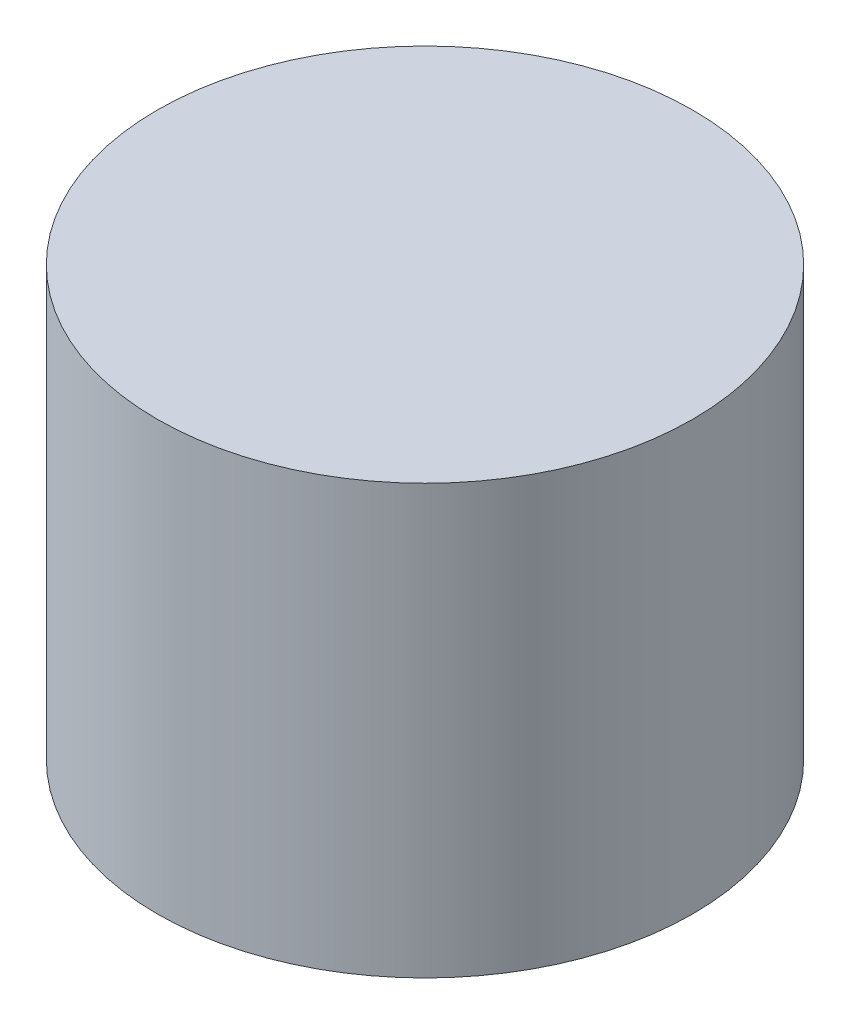
ISO-10303-21;
HEADER;
FILE_DESCRIPTION(('STEP AP214'),'2;1');
FILE_NAME('part.step','',(''),(''),'','','');
FILE_SCHEMA(('AUTOMOTIVE_DESIGN { 1 0 10303 214 1 1 1 1 }'));
ENDSEC;
DATA;
#1=APPLICATION_CONTEXT('core data for automotive mechanical design processes');
#2=APPLICATION_PROTOCOL_DEFINITION('international standard','automotive_design',2000,#1);
#3=PRODUCT_CONTEXT('',#1,'mechanical');
#4=PRODUCT('Part','Part','',(#3));
#5=PRODUCT_RELATED_PRODUCT_CATEGORY('part','',(#4));
#6=PRODUCT_DEFINITION_FORMATION('','',#4);
#7=PRODUCT_DEFINITION_CONTEXT('part definition',#1,'design');
#8=PRODUCT_DEFINITION('design','',#6,#7);
#9=PRODUCT_DEFINITION_SHAPE('','',#8);
#10=(LENGTH_UNIT() NAMED_UNIT(*) SI_UNIT(.MILLI.,.METRE.));
#11=(NAMED_UNIT(*) PLANE_ANGLE_UNIT() SI_UNIT($,.RADIAN.));
#12=(NAMED_UNIT(*) SI_UNIT($,.STERADIAN.) SOLID_ANGLE_UNIT());
#13=UNCERTAINTY_MEASURE_WITH_UNIT(LENGTH_MEASURE(1.E-05),#10,'distance_accuracy_value','');
#14=(GEOMETRIC_REPRESENTATION_CONTEXT(3) GLOBAL_UNCERTAINTY_ASSIGNED_CONTEXT((#13)) GLOBAL_UNIT_ASSIGNED_CONTEXT((#10,
#11,#12)) REPRESENTATION_CONTEXT('',''));
#15=CARTESIAN_POINT('',(0.,0.,0.));
#16=DIRECTION('',(0.,0.,1.));
#17=DIRECTION('',(1.,0.,0.));
#18=AXIS2_PLACEMENT_3D('',#15,#16,#17);
#19=CARTESIAN_POINT('',(0.,4.8,0.));
#20=DIRECTION('',(0.,-1.,0.));
#21=DIRECTION('',(0.,0.,-1.));
#22=AXIS2_PLACEMENT_3D('',#19,#20,#21);
#23=CYLINDRICAL_SURFACE('',#22,3.);
#24=CARTESIAN_POINT('',(0.,4.8,0.));
#25=DIRECTION('',(0.,1.,0.));
#26=DIRECTION('',(0.,0.,1.));
#27=AXIS2_PLACEMENT_3D('',#24,#25,#26);
#28=CIRCLE('',#27,3.);
#29=CARTESIAN_POINT('',(0.,4.8,3.));
#30=VERTEX_POINT('',#29);
#31=EDGE_CURVE('E10',#30,#30,#28,.T.);
#32=ORIENTED_EDGE('',*,*,#31,.F.);
#33=EDGE_LOOP('',(#32));
#34=FACE_BOUND('',#33,.T.);
#35=CARTESIAN_POINT('',(0.,0.,0.));
#36=DIRECTION('',(0.,1.,0.));
#37=DIRECTION('',(0.,0.,1.));
#38=AXIS2_PLACEMENT_3D('',#35,#36,#37);
#39=CIRCLE('',#38,3.);
#40=CARTESIAN_POINT('',(0.,0.,3.));
#41=VERTEX_POINT('',#40);
#42=EDGE_CURVE('E36',#41,#41,#39,.T.);
#43=ORIENTED_EDGE('',*,*,#42,.T.);
#44=EDGE_LOOP('',(#43));
#45=FACE_BOUND('',#44,.T.);
#46=ADVANCED_FACE('F33',(#34,#45),#23,.T.);
#47=CARTESIAN_POINT('',(0.,4.8,0.));
#48=DIRECTION('',(0.,1.,0.));
#49=DIRECTION('',(0.,0.,1.));
#50=AXIS2_PLACEMENT_3D('',#47,#48,#49);
#51=PLANE('',#50);
#52=ORIENTED_EDGE('',*,*,#31,.T.);
#53=EDGE_LOOP('',(#52));
#54=FACE_BOUND('',#53,.T.);
#55=ADVANCED_FACE('F48',(#54),#51,.T.);
#56=CARTESIAN_POINT('',(0.,0.,0.));
#57=DIRECTION('',(0.,1.,0.));
#58=DIRECTION('',(0.,0.,1.));
#59=AXIS2_PLACEMENT_3D('',#56,#57,#58);
#60=PLANE('',#59);
#61=ORIENTED_EDGE('',*,*,#42,.F.);
#62=EDGE_LOOP('',(#61));
#63=FACE_BOUND('',#62,.T.);
#64=ADVANCED_FACE('F46',(#63),#60,.F.);
#65=CLOSED_SHELL('',(#46,#55,#64));
#66=MANIFOLD_SOLID_BREP('B2',#65);
#67=ADVANCED_BREP_SHAPE_REPRESENTATION('',(#18,#66),#14);
#68=SHAPE_DEFINITION_REPRESENTATION(#9,#67);
ENDSEC;
END-ISO-10303-21;
